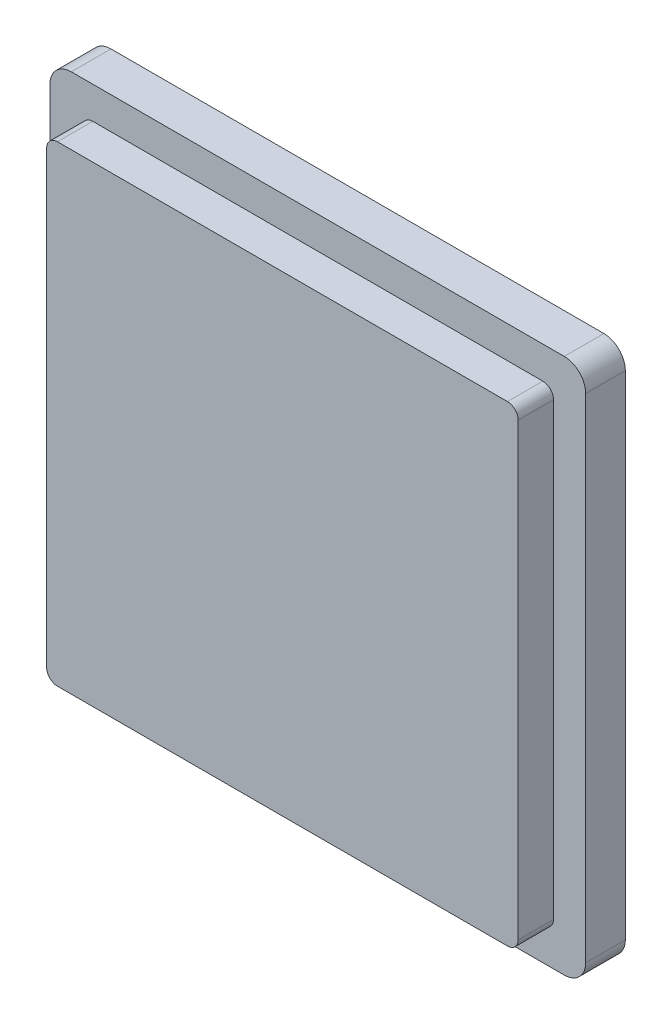
ISO-10303-21;
HEADER;
FILE_DESCRIPTION(('STEP AP214'),'2;1');
FILE_NAME('part.step','',(''),(''),'','','');
FILE_SCHEMA(('AUTOMOTIVE_DESIGN { 1 0 10303 214 1 1 1 1 }'));
ENDSEC;
DATA;
#1=APPLICATION_CONTEXT('core data for automotive mechanical design processes');
#2=APPLICATION_PROTOCOL_DEFINITION('international standard','automotive_design',2000,#1);
#3=PRODUCT_CONTEXT('',#1,'mechanical');
#4=PRODUCT('Part','Part','',(#3));
#5=PRODUCT_RELATED_PRODUCT_CATEGORY('part','',(#4));
#6=PRODUCT_DEFINITION_FORMATION('','',#4);
#7=PRODUCT_DEFINITION_CONTEXT('part definition',#1,'design');
#8=PRODUCT_DEFINITION('design','',#6,#7);
#9=PRODUCT_DEFINITION_SHAPE('','',#8);
#10=(LENGTH_UNIT() NAMED_UNIT(*) SI_UNIT(.MILLI.,.METRE.));
#11=(NAMED_UNIT(*) PLANE_ANGLE_UNIT() SI_UNIT($,.RADIAN.));
#12=(NAMED_UNIT(*) SI_UNIT($,.STERADIAN.) SOLID_ANGLE_UNIT());
#13=UNCERTAINTY_MEASURE_WITH_UNIT(LENGTH_MEASURE(1.E-05),#10,'distance_accuracy_value','');
#14=(GEOMETRIC_REPRESENTATION_CONTEXT(3) GLOBAL_UNCERTAINTY_ASSIGNED_CONTEXT((#13)) GLOBAL_UNIT_ASSIGNED_CONTEXT((#10,
#11,#12)) REPRESENTATION_CONTEXT('',''));
#15=CARTESIAN_POINT('',(0.,0.,0.));
#16=DIRECTION('',(0.,0.,1.));
#17=DIRECTION('',(1.,0.,0.));
#18=AXIS2_PLACEMENT_3D('',#15,#16,#17);
#19=CARTESIAN_POINT('',(-23.0000000004282,-23.,3.7));
#20=DIRECTION('',(0.,0.,-1.));
#21=DIRECTION('',(-1.,0.,0.));
#22=AXIS2_PLACEMENT_3D('',#19,#20,#21);
#23=PLANE('',#22);
#24=CARTESIAN_POINT('',(-23.0000000004282,-23.,3.7));
#25=DIRECTION('',(0.,0.,1.));
#26=DIRECTION('',(-1.,0.,0.));
#27=AXIS2_PLACEMENT_3D('',#24,#25,#26);
#28=CIRCLE('',#27,2.);
#29=CARTESIAN_POINT('',(-25.0000000004282,-23.,3.7));
#30=VERTEX_POINT('',#29);
#31=CARTESIAN_POINT('',(-23.0000000004282,-25.,3.7));
#32=VERTEX_POINT('',#31);
#33=EDGE_CURVE('E175',#30,#32,#28,.T.);
#34=ORIENTED_EDGE('',*,*,#33,.T.);
#35=DIRECTION('',(1.,0.,0.));
#36=VECTOR('',#35,1.);
#37=CARTESIAN_POINT('',(23.0000000004282,-25.,3.7));
#38=LINE('',#37,#36);
#39=CARTESIAN_POINT('',(23.0000000004282,-25.,3.7));
#40=VERTEX_POINT('',#39);
#41=EDGE_CURVE('E178',#32,#40,#38,.T.);
#42=ORIENTED_EDGE('',*,*,#41,.T.);
#43=CARTESIAN_POINT('',(23.0000000004283,-23.,3.7));
#44=DIRECTION('',(0.,0.,1.));
#45=DIRECTION('',(-1.,0.,0.));
#46=AXIS2_PLACEMENT_3D('',#43,#44,#45);
#47=CIRCLE('',#46,2.);
#48=CARTESIAN_POINT('',(25.0000000004282,-23.,3.7));
#49=VERTEX_POINT('',#48);
#50=EDGE_CURVE('E181',#40,#49,#47,.T.);
#51=ORIENTED_EDGE('',*,*,#50,.T.);
#52=DIRECTION('',(0.,1.,0.));
#53=VECTOR('',#52,1.);
#54=CARTESIAN_POINT('',(25.0000000004283,23.,3.7));
#55=LINE('',#54,#53);
#56=CARTESIAN_POINT('',(25.0000000004283,23.,3.7));
#57=VERTEX_POINT('',#56);
#58=EDGE_CURVE('E183',#49,#57,#55,.T.);
#59=ORIENTED_EDGE('',*,*,#58,.T.);
#60=CARTESIAN_POINT('',(23.0000000004283,23.,3.7));
#61=DIRECTION('',(0.,0.,1.));
#62=DIRECTION('',(1.,0.,0.));
#63=AXIS2_PLACEMENT_3D('',#60,#61,#62);
#64=CIRCLE('',#63,2.);
#65=CARTESIAN_POINT('',(23.0000000004282,25.,3.7));
#66=VERTEX_POINT('',#65);
#67=EDGE_CURVE('E185',#57,#66,#64,.T.);
#68=ORIENTED_EDGE('',*,*,#67,.T.);
#69=DIRECTION('',(-1.,0.,0.));
#70=VECTOR('',#69,1.);
#71=CARTESIAN_POINT('',(23.0000000004282,25.,3.7));
#72=LINE('',#71,#70);
#73=CARTESIAN_POINT('',(-23.0000000004282,25.,3.7));
#74=VERTEX_POINT('',#73);
#75=EDGE_CURVE('E187',#66,#74,#72,.T.);
#76=ORIENTED_EDGE('',*,*,#75,.T.);
#77=CARTESIAN_POINT('',(-23.0000000004283,23.,3.7));
#78=DIRECTION('',(0.,0.,1.));
#79=DIRECTION('',(1.,0.,0.));
#80=AXIS2_PLACEMENT_3D('',#77,#78,#79);
#81=CIRCLE('',#80,2.);
#82=CARTESIAN_POINT('',(-25.0000000004283,23.,3.7));
#83=VERTEX_POINT('',#82);
#84=EDGE_CURVE('E189',#74,#83,#81,.T.);
#85=ORIENTED_EDGE('',*,*,#84,.T.);
#86=DIRECTION('',(0.,-1.,0.));
#87=VECTOR('',#86,1.);
#88=CARTESIAN_POINT('',(-25.0000000004283,23.,3.7));
#89=LINE('',#88,#87);
#90=EDGE_CURVE('E191',#83,#30,#89,.T.);
#91=ORIENTED_EDGE('',*,*,#90,.T.);
#92=EDGE_LOOP('',(#34,#42,#51,#59,#68,#76,#85,#91));
#93=FACE_BOUND('',#92,.T.);
#94=CARTESIAN_POINT('',(21.0000000004282,-21.,3.7));
#95=DIRECTION('',(0.,0.,1.));
#96=DIRECTION('',(-1.,0.,0.));
#97=AXIS2_PLACEMENT_3D('',#94,#95,#96);
#98=CIRCLE('',#97,1.);
#99=CARTESIAN_POINT('',(21.0000000004282,-22.,3.7));
#100=VERTEX_POINT('',#99);
#101=CARTESIAN_POINT('',(22.0000000004282,-21.,3.7));
#102=VERTEX_POINT('',#101);
#103=EDGE_CURVE('E165',#100,#102,#98,.T.);
#104=ORIENTED_EDGE('',*,*,#103,.F.);
#105=DIRECTION('',(1.,0.,0.));
#106=VECTOR('',#105,1.);
#107=CARTESIAN_POINT('',(-21.0000000004282,-22.,3.7));
#108=LINE('',#107,#106);
#109=CARTESIAN_POINT('',(-21.0000000004282,-22.,3.7));
#110=VERTEX_POINT('',#109);
#111=EDGE_CURVE('E162',#110,#100,#108,.T.);
#112=ORIENTED_EDGE('',*,*,#111,.F.);
#113=CARTESIAN_POINT('',(-21.0000000004282,-21.,3.7));
#114=DIRECTION('',(0.,0.,1.));
#115=DIRECTION('',(-1.,0.,0.));
#116=AXIS2_PLACEMENT_3D('',#113,#114,#115);
#117=CIRCLE('',#116,1.);
#118=CARTESIAN_POINT('',(-22.0000000004282,-21.,3.7));
#119=VERTEX_POINT('',#118);
#120=EDGE_CURVE('E431',#119,#110,#117,.T.);
#121=ORIENTED_EDGE('',*,*,#120,.F.);
#122=DIRECTION('',(0.,-1.,0.));
#123=VECTOR('',#122,1.);
#124=CARTESIAN_POINT('',(-22.0000000004282,-21.,3.7));
#125=LINE('',#124,#123);
#126=CARTESIAN_POINT('',(-22.0000000004282,21.,3.7));
#127=VERTEX_POINT('',#126);
#128=EDGE_CURVE('E462',#127,#119,#125,.T.);
#129=ORIENTED_EDGE('',*,*,#128,.F.);
#130=CARTESIAN_POINT('',(-21.0000000004282,21.,3.7));
#131=DIRECTION('',(0.,0.,1.));
#132=DIRECTION('',(-1.,0.,0.));
#133=AXIS2_PLACEMENT_3D('',#130,#131,#132);
#134=CIRCLE('',#133,1.);
#135=CARTESIAN_POINT('',(-21.0000000004282,22.,3.7));
#136=VERTEX_POINT('',#135);
#137=EDGE_CURVE('E455',#136,#127,#134,.T.);
#138=ORIENTED_EDGE('',*,*,#137,.F.);
#139=DIRECTION('',(-1.,0.,0.));
#140=VECTOR('',#139,1.);
#141=CARTESIAN_POINT('',(-21.0000000004282,22.,3.7));
#142=LINE('',#141,#140);
#143=CARTESIAN_POINT('',(21.0000000004282,22.,3.7));
#144=VERTEX_POINT('',#143);
#145=EDGE_CURVE('E452',#144,#136,#142,.T.);
#146=ORIENTED_EDGE('',*,*,#145,.F.);
#147=CARTESIAN_POINT('',(21.0000000004282,21.,3.7));
#148=DIRECTION('',(0.,0.,1.));
#149=DIRECTION('',(1.,0.,0.));
#150=AXIS2_PLACEMENT_3D('',#147,#148,#149);
#151=CIRCLE('',#150,1.);
#152=CARTESIAN_POINT('',(22.0000000004282,21.,3.7));
#153=VERTEX_POINT('',#152);
#154=EDGE_CURVE('E52',#153,#144,#151,.T.);
#155=ORIENTED_EDGE('',*,*,#154,.F.);
#156=DIRECTION('',(0.,1.,0.));
#157=VECTOR('',#156,1.);
#158=CARTESIAN_POINT('',(22.0000000004282,-21.,3.7));
#159=LINE('',#158,#157);
#160=EDGE_CURVE('E47',#102,#153,#159,.T.);
#161=ORIENTED_EDGE('',*,*,#160,.F.);
#162=EDGE_LOOP('',(#104,#112,#121,#129,#138,#146,#155,#161));
#163=FACE_BOUND('',#162,.T.);
#164=ADVANCED_FACE('F32',(#93,#163),#23,.F.);
#165=CARTESIAN_POINT('',(-23.0000000004282,-23.,3.7));
#166=DIRECTION('',(0.,0.,-1.));
#167=DIRECTION('',(-1.,0.,0.));
#168=AXIS2_PLACEMENT_3D('',#165,#166,#167);
#169=CYLINDRICAL_SURFACE('',#168,2.);
#170=CARTESIAN_POINT('',(-23.0000000004282,-23.,0.));
#171=DIRECTION('',(0.,0.,1.));
#172=DIRECTION('',(-1.,0.,0.));
#173=AXIS2_PLACEMENT_3D('',#170,#171,#172);
#174=CIRCLE('',#173,2.);
#175=CARTESIAN_POINT('',(-25.0000000004282,-23.,0.));
#176=VERTEX_POINT('',#175);
#177=CARTESIAN_POINT('',(-23.0000000004282,-25.,0.));
#178=VERTEX_POINT('',#177);
#179=EDGE_CURVE('E166',#176,#178,#174,.T.);
#180=ORIENTED_EDGE('',*,*,#179,.T.);
#181=DIRECTION('',(0.,0.,-1.));
#182=VECTOR('',#181,1.);
#183=CARTESIAN_POINT('',(-23.0000000004282,-25.,3.7));
#184=LINE('',#183,#182);
#185=EDGE_CURVE('E11',#32,#178,#184,.T.);
#186=ORIENTED_EDGE('',*,*,#185,.F.);
#187=ORIENTED_EDGE('',*,*,#33,.F.);
#188=DIRECTION('',(0.,0.,-1.));
#189=VECTOR('',#188,1.);
#190=CARTESIAN_POINT('',(-25.0000000004282,-23.,3.7));
#191=LINE('',#190,#189);
#192=EDGE_CURVE('E192',#30,#176,#191,.T.);
#193=ORIENTED_EDGE('',*,*,#192,.T.);
#194=EDGE_LOOP('',(#180,#186,#187,#193));
#195=FACE_BOUND('',#194,.T.);
#196=ADVANCED_FACE('F34',(#195),#169,.T.);
#197=CARTESIAN_POINT('',(23.0000000004282,-25.,3.7));
#198=DIRECTION('',(0.,1.,0.));
#199=DIRECTION('',(-1.,0.,0.));
#200=AXIS2_PLACEMENT_3D('',#197,#198,#199);
#201=PLANE('',#200);
#202=DIRECTION('',(1.,0.,0.));
#203=VECTOR('',#202,1.);
#204=CARTESIAN_POINT('',(23.0000000004282,-25.,0.));
#205=LINE('',#204,#203);
#206=CARTESIAN_POINT('',(23.0000000004282,-25.,0.));
#207=VERTEX_POINT('',#206);
#208=EDGE_CURVE('E169',#178,#207,#205,.T.);
#209=ORIENTED_EDGE('',*,*,#208,.T.);
#210=DIRECTION('',(0.,0.,-1.));
#211=VECTOR('',#210,1.);
#212=CARTESIAN_POINT('',(23.0000000004282,-25.,3.7));
#213=LINE('',#212,#211);
#214=EDGE_CURVE('E40',#40,#207,#213,.T.);
#215=ORIENTED_EDGE('',*,*,#214,.F.);
#216=ORIENTED_EDGE('',*,*,#41,.F.);
#217=ORIENTED_EDGE('',*,*,#185,.T.);
#218=EDGE_LOOP('',(#209,#215,#216,#217));
#219=FACE_BOUND('',#218,.T.);
#220=ADVANCED_FACE('F249',(#219),#201,.F.);
#221=CARTESIAN_POINT('',(23.0000000004283,-23.,3.7));
#222=DIRECTION('',(0.,0.,-1.));
#223=DIRECTION('',(-1.,0.,0.));
#224=AXIS2_PLACEMENT_3D('',#221,#222,#223);
#225=CYLINDRICAL_SURFACE('',#224,2.);
#226=CARTESIAN_POINT('',(23.0000000004283,-23.,0.));
#227=DIRECTION('',(0.,0.,1.));
#228=DIRECTION('',(-1.,0.,0.));
#229=AXIS2_PLACEMENT_3D('',#226,#227,#228);
#230=CIRCLE('',#229,2.);
#231=CARTESIAN_POINT('',(25.0000000004282,-23.,0.));
#232=VERTEX_POINT('',#231);
#233=EDGE_CURVE('E195',#207,#232,#230,.T.);
#234=ORIENTED_EDGE('',*,*,#233,.T.);
#235=DIRECTION('',(0.,0.,-1.));
#236=VECTOR('',#235,1.);
#237=CARTESIAN_POINT('',(25.0000000004282,-23.,3.7));
#238=LINE('',#237,#236);
#239=EDGE_CURVE('E220',#49,#232,#238,.T.);
#240=ORIENTED_EDGE('',*,*,#239,.F.);
#241=ORIENTED_EDGE('',*,*,#50,.F.);
#242=ORIENTED_EDGE('',*,*,#214,.T.);
#243=EDGE_LOOP('',(#234,#240,#241,#242));
#244=FACE_BOUND('',#243,.T.);
#245=ADVANCED_FACE('F227',(#244),#225,.T.);
#246=CARTESIAN_POINT('',(25.0000000004283,23.,3.7));
#247=DIRECTION('',(-1.,0.,0.));
#248=DIRECTION('',(0.,-1.,0.));
#249=AXIS2_PLACEMENT_3D('',#246,#247,#248);
#250=PLANE('',#249);
#251=DIRECTION('',(0.,1.,0.));
#252=VECTOR('',#251,1.);
#253=CARTESIAN_POINT('',(25.0000000004283,23.,0.));
#254=LINE('',#253,#252);
#255=CARTESIAN_POINT('',(25.0000000004283,23.,0.));
#256=VERTEX_POINT('',#255);
#257=EDGE_CURVE('E197',#232,#256,#254,.T.);
#258=ORIENTED_EDGE('',*,*,#257,.T.);
#259=DIRECTION('',(0.,0.,-1.));
#260=VECTOR('',#259,1.);
#261=CARTESIAN_POINT('',(25.0000000004283,23.,3.7));
#262=LINE('',#261,#260);
#263=EDGE_CURVE('E217',#57,#256,#262,.T.);
#264=ORIENTED_EDGE('',*,*,#263,.F.);
#265=ORIENTED_EDGE('',*,*,#58,.F.);
#266=ORIENTED_EDGE('',*,*,#239,.T.);
#267=EDGE_LOOP('',(#258,#264,#265,#266));
#268=FACE_BOUND('',#267,.T.);
#269=ADVANCED_FACE('F238',(#268),#250,.F.);
#270=CARTESIAN_POINT('',(23.0000000004283,23.,3.7));
#271=DIRECTION('',(0.,0.,-1.));
#272=DIRECTION('',(-1.,0.,0.));
#273=AXIS2_PLACEMENT_3D('',#270,#271,#272);
#274=CYLINDRICAL_SURFACE('',#273,2.);
#275=CARTESIAN_POINT('',(23.0000000004283,23.,0.));
#276=DIRECTION('',(0.,0.,1.));
#277=DIRECTION('',(1.,0.,0.));
#278=AXIS2_PLACEMENT_3D('',#275,#276,#277);
#279=CIRCLE('',#278,2.);
#280=CARTESIAN_POINT('',(23.0000000004282,25.,0.));
#281=VERTEX_POINT('',#280);
#282=EDGE_CURVE('E199',#256,#281,#279,.T.);
#283=ORIENTED_EDGE('',*,*,#282,.T.);
#284=DIRECTION('',(0.,0.,-1.));
#285=VECTOR('',#284,1.);
#286=CARTESIAN_POINT('',(23.0000000004282,25.,3.7));
#287=LINE('',#286,#285);
#288=EDGE_CURVE('E214',#66,#281,#287,.T.);
#289=ORIENTED_EDGE('',*,*,#288,.F.);
#290=ORIENTED_EDGE('',*,*,#67,.F.);
#291=ORIENTED_EDGE('',*,*,#263,.T.);
#292=EDGE_LOOP('',(#283,#289,#290,#291));
#293=FACE_BOUND('',#292,.T.);
#294=ADVANCED_FACE('F242',(#293),#274,.T.);
#295=CARTESIAN_POINT('',(23.0000000004282,25.,3.7));
#296=DIRECTION('',(0.,-1.,0.));
#297=DIRECTION('',(1.,0.,0.));
#298=AXIS2_PLACEMENT_3D('',#295,#296,#297);
#299=PLANE('',#298);
#300=DIRECTION('',(-1.,0.,0.));
#301=VECTOR('',#300,1.);
#302=CARTESIAN_POINT('',(23.0000000004282,25.,0.));
#303=LINE('',#302,#301);
#304=CARTESIAN_POINT('',(-23.0000000004282,25.,0.));
#305=VERTEX_POINT('',#304);
#306=EDGE_CURVE('E201',#281,#305,#303,.T.);
#307=ORIENTED_EDGE('',*,*,#306,.T.);
#308=DIRECTION('',(0.,0.,-1.));
#309=VECTOR('',#308,1.);
#310=CARTESIAN_POINT('',(-23.0000000004282,25.,3.7));
#311=LINE('',#310,#309);
#312=EDGE_CURVE('E211',#74,#305,#311,.T.);
#313=ORIENTED_EDGE('',*,*,#312,.F.);
#314=ORIENTED_EDGE('',*,*,#75,.F.);
#315=ORIENTED_EDGE('',*,*,#288,.T.);
#316=EDGE_LOOP('',(#307,#313,#314,#315));
#317=FACE_BOUND('',#316,.T.);
#318=ADVANCED_FACE('F262',(#317),#299,.F.);
#319=CARTESIAN_POINT('',(-23.0000000004283,23.,3.7));
#320=DIRECTION('',(0.,0.,-1.));
#321=DIRECTION('',(-1.,0.,0.));
#322=AXIS2_PLACEMENT_3D('',#319,#320,#321);
#323=CYLINDRICAL_SURFACE('',#322,2.);
#324=CARTESIAN_POINT('',(-23.0000000004283,23.,0.));
#325=DIRECTION('',(0.,0.,1.));
#326=DIRECTION('',(1.,0.,0.));
#327=AXIS2_PLACEMENT_3D('',#324,#325,#326);
#328=CIRCLE('',#327,2.);
#329=CARTESIAN_POINT('',(-25.0000000004283,23.,0.));
#330=VERTEX_POINT('',#329);
#331=EDGE_CURVE('E203',#305,#330,#328,.T.);
#332=ORIENTED_EDGE('',*,*,#331,.T.);
#333=DIRECTION('',(0.,0.,-1.));
#334=VECTOR('',#333,1.);
#335=CARTESIAN_POINT('',(-25.0000000004283,23.,3.7));
#336=LINE('',#335,#334);
#337=EDGE_CURVE('E208',#83,#330,#336,.T.);
#338=ORIENTED_EDGE('',*,*,#337,.F.);
#339=ORIENTED_EDGE('',*,*,#84,.F.);
#340=ORIENTED_EDGE('',*,*,#312,.T.);
#341=EDGE_LOOP('',(#332,#338,#339,#340));
#342=FACE_BOUND('',#341,.T.);
#343=ADVANCED_FACE('F260',(#342),#323,.T.);
#344=CARTESIAN_POINT('',(-25.0000000004283,23.,3.7));
#345=DIRECTION('',(1.,0.,0.));
#346=DIRECTION('',(0.,1.,0.));
#347=AXIS2_PLACEMENT_3D('',#344,#345,#346);
#348=PLANE('',#347);
#349=DIRECTION('',(0.,-1.,0.));
#350=VECTOR('',#349,1.);
#351=CARTESIAN_POINT('',(-25.0000000004283,23.,0.));
#352=LINE('',#351,#350);
#353=EDGE_CURVE('E179',#330,#176,#352,.T.);
#354=ORIENTED_EDGE('',*,*,#353,.T.);
#355=ORIENTED_EDGE('',*,*,#192,.F.);
#356=ORIENTED_EDGE('',*,*,#90,.F.);
#357=ORIENTED_EDGE('',*,*,#337,.T.);
#358=EDGE_LOOP('',(#354,#355,#356,#357));
#359=FACE_BOUND('',#358,.T.);
#360=ADVANCED_FACE('F255',(#359),#348,.F.);
#361=CARTESIAN_POINT('',(-23.0000000004282,-23.,0.));
#362=DIRECTION('',(0.,0.,-1.));
#363=DIRECTION('',(-1.,0.,0.));
#364=AXIS2_PLACEMENT_3D('',#361,#362,#363);
#365=PLANE('',#364);
#366=ORIENTED_EDGE('',*,*,#179,.F.);
#367=ORIENTED_EDGE('',*,*,#353,.F.);
#368=ORIENTED_EDGE('',*,*,#331,.F.);
#369=ORIENTED_EDGE('',*,*,#306,.F.);
#370=ORIENTED_EDGE('',*,*,#282,.F.);
#371=ORIENTED_EDGE('',*,*,#257,.F.);
#372=ORIENTED_EDGE('',*,*,#233,.F.);
#373=ORIENTED_EDGE('',*,*,#208,.F.);
#374=EDGE_LOOP('',(#366,#367,#368,#369,#370,#371,#372,#373));
#375=FACE_BOUND('',#374,.T.);
#376=ADVANCED_FACE('F233',(#375),#365,.T.);
#377=CARTESIAN_POINT('',(21.0000000004282,-21.,7.));
#378=DIRECTION('',(0.,0.,-1.));
#379=DIRECTION('',(-1.,0.,0.));
#380=AXIS2_PLACEMENT_3D('',#377,#378,#379);
#381=CYLINDRICAL_SURFACE('',#380,1.);
#382=ORIENTED_EDGE('',*,*,#103,.T.);
#383=DIRECTION('',(0.,0.,-1.));
#384=VECTOR('',#383,1.);
#385=CARTESIAN_POINT('',(22.0000000004282,-21.,7.));
#386=LINE('',#385,#384);
#387=CARTESIAN_POINT('',(22.0000000004282,-21.,7.));
#388=VERTEX_POINT('',#387);
#389=EDGE_CURVE('E146',#388,#102,#386,.T.);
#390=ORIENTED_EDGE('',*,*,#389,.F.);
#391=CARTESIAN_POINT('',(21.0000000004282,-21.,7.));
#392=DIRECTION('',(0.,0.,1.));
#393=DIRECTION('',(-1.,0.,0.));
#394=AXIS2_PLACEMENT_3D('',#391,#392,#393);
#395=CIRCLE('',#394,1.);
#396=CARTESIAN_POINT('',(21.0000000004282,-22.,7.));
#397=VERTEX_POINT('',#396);
#398=EDGE_CURVE('E153',#397,#388,#395,.T.);
#399=ORIENTED_EDGE('',*,*,#398,.F.);
#400=DIRECTION('',(0.,0.,-1.));
#401=VECTOR('',#400,1.);
#402=CARTESIAN_POINT('',(21.0000000004282,-22.,7.));
#403=LINE('',#402,#401);
#404=EDGE_CURVE('E427',#397,#100,#403,.T.);
#405=ORIENTED_EDGE('',*,*,#404,.T.);
#406=EDGE_LOOP('',(#382,#390,#399,#405));
#407=FACE_BOUND('',#406,.T.);
#408=ADVANCED_FACE('F164',(#407),#381,.T.);
#409=CARTESIAN_POINT('',(22.0000000004282,-21.,7.));
#410=DIRECTION('',(-1.,0.,0.));
#411=DIRECTION('',(0.,-1.,0.));
#412=AXIS2_PLACEMENT_3D('',#409,#410,#411);
#413=PLANE('',#412);
#414=ORIENTED_EDGE('',*,*,#160,.T.);
#415=DIRECTION('',(0.,0.,-1.));
#416=VECTOR('',#415,1.);
#417=CARTESIAN_POINT('',(22.0000000004282,21.,7.));
#418=LINE('',#417,#416);
#419=CARTESIAN_POINT('',(22.0000000004282,21.,7.));
#420=VERTEX_POINT('',#419);
#421=EDGE_CURVE('E149',#420,#153,#418,.T.);
#422=ORIENTED_EDGE('',*,*,#421,.F.);
#423=DIRECTION('',(0.,1.,0.));
#424=VECTOR('',#423,1.);
#425=CARTESIAN_POINT('',(22.0000000004282,-21.,7.));
#426=LINE('',#425,#424);
#427=EDGE_CURVE('E142',#388,#420,#426,.T.);
#428=ORIENTED_EDGE('',*,*,#427,.F.);
#429=ORIENTED_EDGE('',*,*,#389,.T.);
#430=EDGE_LOOP('',(#414,#422,#428,#429));
#431=FACE_BOUND('',#430,.T.);
#432=ADVANCED_FACE('F144',(#431),#413,.F.);
#433=CARTESIAN_POINT('',(21.0000000004282,21.,7.));
#434=DIRECTION('',(0.,0.,-1.));
#435=DIRECTION('',(-1.,0.,0.));
#436=AXIS2_PLACEMENT_3D('',#433,#434,#435);
#437=CYLINDRICAL_SURFACE('',#436,1.);
#438=ORIENTED_EDGE('',*,*,#154,.T.);
#439=DIRECTION('',(0.,0.,-1.));
#440=VECTOR('',#439,1.);
#441=CARTESIAN_POINT('',(21.0000000004282,22.,7.));
#442=LINE('',#441,#440);
#443=CARTESIAN_POINT('',(21.0000000004282,22.,7.));
#444=VERTEX_POINT('',#443);
#445=EDGE_CURVE('E171',#444,#144,#442,.T.);
#446=ORIENTED_EDGE('',*,*,#445,.F.);
#447=CARTESIAN_POINT('',(21.0000000004282,21.,7.));
#448=DIRECTION('',(0.,0.,1.));
#449=DIRECTION('',(1.,0.,0.));
#450=AXIS2_PLACEMENT_3D('',#447,#448,#449);
#451=CIRCLE('',#450,1.);
#452=EDGE_CURVE('E152',#420,#444,#451,.T.);
#453=ORIENTED_EDGE('',*,*,#452,.F.);
#454=ORIENTED_EDGE('',*,*,#421,.T.);
#455=EDGE_LOOP('',(#438,#446,#453,#454));
#456=FACE_BOUND('',#455,.T.);
#457=ADVANCED_FACE('F301',(#456),#437,.T.);
#458=CARTESIAN_POINT('',(-21.0000000004282,22.,7.));
#459=DIRECTION('',(0.,-1.,0.));
#460=DIRECTION('',(1.,0.,0.));
#461=AXIS2_PLACEMENT_3D('',#458,#459,#460);
#462=PLANE('',#461);
#463=ORIENTED_EDGE('',*,*,#145,.T.);
#464=DIRECTION('',(0.,0.,-1.));
#465=VECTOR('',#464,1.);
#466=CARTESIAN_POINT('',(-21.0000000004282,22.,7.));
#467=LINE('',#466,#465);
#468=CARTESIAN_POINT('',(-21.0000000004282,22.,7.));
#469=VERTEX_POINT('',#468);
#470=EDGE_CURVE('E445',#469,#136,#467,.T.);
#471=ORIENTED_EDGE('',*,*,#470,.F.);
#472=DIRECTION('',(-1.,0.,0.));
#473=VECTOR('',#472,1.);
#474=CARTESIAN_POINT('',(-21.0000000004282,22.,7.));
#475=LINE('',#474,#473);
#476=EDGE_CURVE('E453',#444,#469,#475,.T.);
#477=ORIENTED_EDGE('',*,*,#476,.F.);
#478=ORIENTED_EDGE('',*,*,#445,.T.);
#479=EDGE_LOOP('',(#463,#471,#477,#478));
#480=FACE_BOUND('',#479,.T.);
#481=ADVANCED_FACE('F307',(#480),#462,.F.);
#482=CARTESIAN_POINT('',(-21.0000000004282,21.,7.));
#483=DIRECTION('',(0.,0.,-1.));
#484=DIRECTION('',(-1.,0.,0.));
#485=AXIS2_PLACEMENT_3D('',#482,#483,#484);
#486=CYLINDRICAL_SURFACE('',#485,1.);
#487=ORIENTED_EDGE('',*,*,#137,.T.);
#488=DIRECTION('',(0.,0.,-1.));
#489=VECTOR('',#488,1.);
#490=CARTESIAN_POINT('',(-22.0000000004282,21.,7.));
#491=LINE('',#490,#489);
#492=CARTESIAN_POINT('',(-22.0000000004282,21.,7.));
#493=VERTEX_POINT('',#492);
#494=EDGE_CURVE('E442',#493,#127,#491,.T.);
#495=ORIENTED_EDGE('',*,*,#494,.F.);
#496=CARTESIAN_POINT('',(-21.0000000004282,21.,7.));
#497=DIRECTION('',(0.,0.,1.));
#498=DIRECTION('',(-1.,0.,0.));
#499=AXIS2_PLACEMENT_3D('',#496,#497,#498);
#500=CIRCLE('',#499,1.);
#501=EDGE_CURVE('E470',#469,#493,#500,.T.);
#502=ORIENTED_EDGE('',*,*,#501,.F.);
#503=ORIENTED_EDGE('',*,*,#470,.T.);
#504=EDGE_LOOP('',(#487,#495,#502,#503));
#505=FACE_BOUND('',#504,.T.);
#506=ADVANCED_FACE('F315',(#505),#486,.T.);
#507=CARTESIAN_POINT('',(-22.0000000004282,-21.,7.));
#508=DIRECTION('',(1.,0.,0.));
#509=DIRECTION('',(0.,1.,0.));
#510=AXIS2_PLACEMENT_3D('',#507,#508,#509);
#511=PLANE('',#510);
#512=ORIENTED_EDGE('',*,*,#128,.T.);
#513=DIRECTION('',(0.,0.,-1.));
#514=VECTOR('',#513,1.);
#515=CARTESIAN_POINT('',(-22.0000000004282,-21.,7.));
#516=LINE('',#515,#514);
#517=CARTESIAN_POINT('',(-22.0000000004282,-21.,7.));
#518=VERTEX_POINT('',#517);
#519=EDGE_CURVE('E434',#518,#119,#516,.T.);
#520=ORIENTED_EDGE('',*,*,#519,.F.);
#521=DIRECTION('',(0.,-1.,0.));
#522=VECTOR('',#521,1.);
#523=CARTESIAN_POINT('',(-22.0000000004282,-21.,7.));
#524=LINE('',#523,#522);
#525=EDGE_CURVE('E468',#493,#518,#524,.T.);
#526=ORIENTED_EDGE('',*,*,#525,.F.);
#527=ORIENTED_EDGE('',*,*,#494,.T.);
#528=EDGE_LOOP('',(#512,#520,#526,#527));
#529=FACE_BOUND('',#528,.T.);
#530=ADVANCED_FACE('F323',(#529),#511,.F.);
#531=CARTESIAN_POINT('',(-21.0000000004282,-21.,7.));
#532=DIRECTION('',(0.,0.,-1.));
#533=DIRECTION('',(-1.,0.,0.));
#534=AXIS2_PLACEMENT_3D('',#531,#532,#533);
#535=CYLINDRICAL_SURFACE('',#534,1.);
#536=ORIENTED_EDGE('',*,*,#120,.T.);
#537=DIRECTION('',(0.,0.,-1.));
#538=VECTOR('',#537,1.);
#539=CARTESIAN_POINT('',(-21.0000000004282,-22.,7.));
#540=LINE('',#539,#538);
#541=CARTESIAN_POINT('',(-21.0000000004282,-22.,7.));
#542=VERTEX_POINT('',#541);
#543=EDGE_CURVE('E429',#542,#110,#540,.T.);
#544=ORIENTED_EDGE('',*,*,#543,.F.);
#545=CARTESIAN_POINT('',(-21.0000000004282,-21.,7.));
#546=DIRECTION('',(0.,0.,1.));
#547=DIRECTION('',(-1.,0.,0.));
#548=AXIS2_PLACEMENT_3D('',#545,#546,#547);
#549=CIRCLE('',#548,1.);
#550=EDGE_CURVE('E436',#518,#542,#549,.T.);
#551=ORIENTED_EDGE('',*,*,#550,.F.);
#552=ORIENTED_EDGE('',*,*,#519,.T.);
#553=EDGE_LOOP('',(#536,#544,#551,#552));
#554=FACE_BOUND('',#553,.T.);
#555=ADVANCED_FACE('F331',(#554),#535,.T.);
#556=CARTESIAN_POINT('',(-21.0000000004282,-22.,7.));
#557=DIRECTION('',(0.,1.,0.));
#558=DIRECTION('',(-1.,0.,0.));
#559=AXIS2_PLACEMENT_3D('',#556,#557,#558);
#560=PLANE('',#559);
#561=ORIENTED_EDGE('',*,*,#111,.T.);
#562=ORIENTED_EDGE('',*,*,#404,.F.);
#563=DIRECTION('',(1.,0.,0.));
#564=VECTOR('',#563,1.);
#565=CARTESIAN_POINT('',(-21.0000000004282,-22.,7.));
#566=LINE('',#565,#564);
#567=EDGE_CURVE('E158',#542,#397,#566,.T.);
#568=ORIENTED_EDGE('',*,*,#567,.F.);
#569=ORIENTED_EDGE('',*,*,#543,.T.);
#570=EDGE_LOOP('',(#561,#562,#568,#569));
#571=FACE_BOUND('',#570,.T.);
#572=ADVANCED_FACE('F339',(#571),#560,.F.);
#573=CARTESIAN_POINT('',(21.0000000004282,-21.,7.));
#574=DIRECTION('',(0.,0.,-1.));
#575=DIRECTION('',(-1.,0.,0.));
#576=AXIS2_PLACEMENT_3D('',#573,#574,#575);
#577=PLANE('',#576);
#578=ORIENTED_EDGE('',*,*,#398,.T.);
#579=ORIENTED_EDGE('',*,*,#427,.T.);
#580=ORIENTED_EDGE('',*,*,#452,.T.);
#581=ORIENTED_EDGE('',*,*,#476,.T.);
#582=ORIENTED_EDGE('',*,*,#501,.T.);
#583=ORIENTED_EDGE('',*,*,#525,.T.);
#584=ORIENTED_EDGE('',*,*,#550,.T.);
#585=ORIENTED_EDGE('',*,*,#567,.T.);
#586=EDGE_LOOP('',(#578,#579,#580,#581,#582,#583,#584,#585));
#587=FACE_BOUND('',#586,.T.);
#588=ADVANCED_FACE('F156',(#587),#577,.F.);
#589=CLOSED_SHELL('',(#164,#196,#220,#245,#269,#294,#318,#343,#360,#376,#408,#432,#457,#481,
#506,#530,#555,#572,#588));
#590=MANIFOLD_SOLID_BREP('B2',#589);
#591=ADVANCED_BREP_SHAPE_REPRESENTATION('',(#18,#590),#14);
#592=SHAPE_DEFINITION_REPRESENTATION(#9,#591);
ENDSEC;
END-ISO-10303-21;
